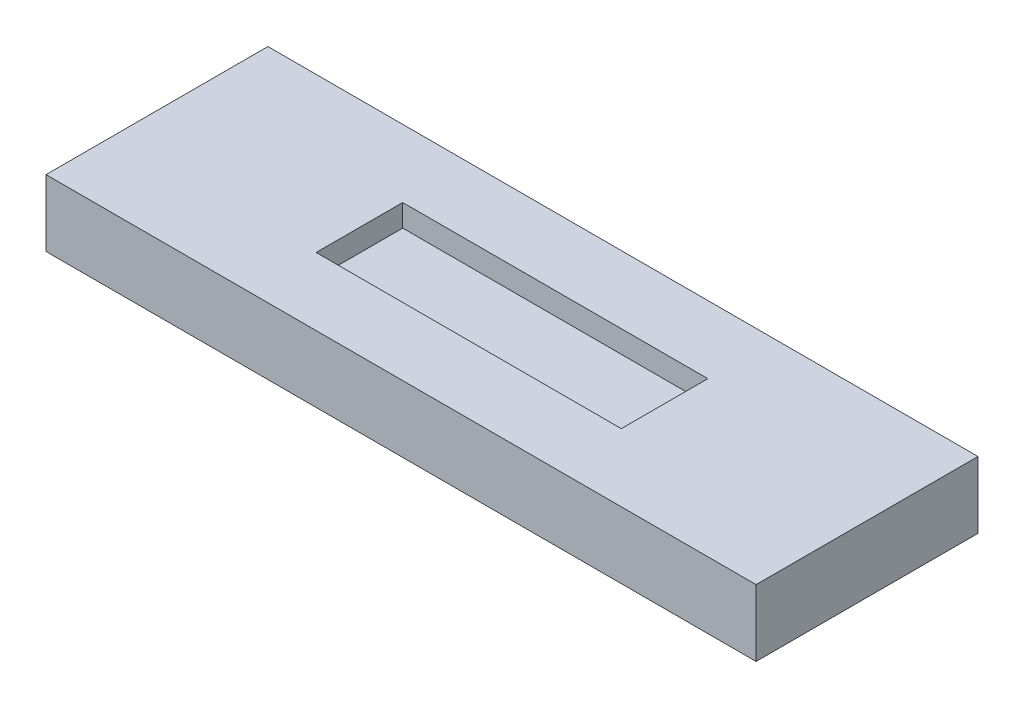
ISO-10303-21;
HEADER;
FILE_DESCRIPTION(('STEP AP214'),'2;1');
FILE_NAME('part.step','',(''),(''),'','','');
FILE_SCHEMA(('AUTOMOTIVE_DESIGN { 1 0 10303 214 1 1 1 1 }'));
ENDSEC;
DATA;
#1=APPLICATION_CONTEXT('core data for automotive mechanical design processes');
#2=APPLICATION_PROTOCOL_DEFINITION('international standard','automotive_design',2000,#1);
#3=PRODUCT_CONTEXT('',#1,'mechanical');
#4=PRODUCT('Part','Part','',(#3));
#5=PRODUCT_RELATED_PRODUCT_CATEGORY('part','',(#4));
#6=PRODUCT_DEFINITION_FORMATION('','',#4);
#7=PRODUCT_DEFINITION_CONTEXT('part definition',#1,'design');
#8=PRODUCT_DEFINITION('design','',#6,#7);
#9=PRODUCT_DEFINITION_SHAPE('','',#8);
#10=(LENGTH_UNIT() NAMED_UNIT(*) SI_UNIT(.MILLI.,.METRE.));
#11=(NAMED_UNIT(*) PLANE_ANGLE_UNIT() SI_UNIT($,.RADIAN.));
#12=(NAMED_UNIT(*) SI_UNIT($,.STERADIAN.) SOLID_ANGLE_UNIT());
#13=UNCERTAINTY_MEASURE_WITH_UNIT(LENGTH_MEASURE(1.E-05),#10,'distance_accuracy_value','');
#14=(GEOMETRIC_REPRESENTATION_CONTEXT(3) GLOBAL_UNCERTAINTY_ASSIGNED_CONTEXT((#13)) GLOBAL_UNIT_ASSIGNED_CONTEXT((#10,
#11,#12)) REPRESENTATION_CONTEXT('',''));
#15=CARTESIAN_POINT('',(0.,0.,0.));
#16=DIRECTION('',(0.,0.,1.));
#17=DIRECTION('',(1.,0.,0.));
#18=AXIS2_PLACEMENT_3D('',#15,#16,#17);
#19=CARTESIAN_POINT('',(16.,3.,5.));
#20=DIRECTION('',(-1.,0.,0.));
#21=DIRECTION('',(0.,0.,1.));
#22=AXIS2_PLACEMENT_3D('',#19,#20,#21);
#23=PLANE('',#22);
#24=DIRECTION('',(0.,0.,-1.));
#25=VECTOR('',#24,1.);
#26=CARTESIAN_POINT('',(16.,0.,5.));
#27=LINE('',#26,#25);
#28=CARTESIAN_POINT('',(16.,0.,5.));
#29=VERTEX_POINT('',#28);
#30=CARTESIAN_POINT('',(16.,0.,-5.));
#31=VERTEX_POINT('',#30);
#32=EDGE_CURVE('E141',#29,#31,#27,.T.);
#33=ORIENTED_EDGE('',*,*,#32,.T.);
#34=DIRECTION('',(0.,-1.,0.));
#35=VECTOR('',#34,1.);
#36=CARTESIAN_POINT('',(16.,3.,-5.));
#37=LINE('',#36,#35);
#38=CARTESIAN_POINT('',(16.,3.,-5.));
#39=VERTEX_POINT('',#38);
#40=EDGE_CURVE('E11',#39,#31,#37,.T.);
#41=ORIENTED_EDGE('',*,*,#40,.F.);
#42=DIRECTION('',(0.,0.,-1.));
#43=VECTOR('',#42,1.);
#44=CARTESIAN_POINT('',(16.,3.,5.));
#45=LINE('',#44,#43);
#46=CARTESIAN_POINT('',(16.,3.,5.));
#47=VERTEX_POINT('',#46);
#48=EDGE_CURVE('E145',#47,#39,#45,.T.);
#49=ORIENTED_EDGE('',*,*,#48,.F.);
#50=DIRECTION('',(0.,-1.,0.));
#51=VECTOR('',#50,1.);
#52=CARTESIAN_POINT('',(16.,3.,5.));
#53=LINE('',#52,#51);
#54=EDGE_CURVE('E151',#47,#29,#53,.T.);
#55=ORIENTED_EDGE('',*,*,#54,.T.);
#56=EDGE_LOOP('',(#33,#41,#49,#55));
#57=FACE_BOUND('',#56,.T.);
#58=ADVANCED_FACE('F33',(#57),#23,.F.);
#59=CARTESIAN_POINT('',(-16.,3.,-5.));
#60=DIRECTION('',(0.,0.,1.));
#61=DIRECTION('',(1.,0.,0.));
#62=AXIS2_PLACEMENT_3D('',#59,#60,#61);
#63=PLANE('',#62);
#64=DIRECTION('',(-1.,0.,0.));
#65=VECTOR('',#64,1.);
#66=CARTESIAN_POINT('',(-16.,0.,-5.));
#67=LINE('',#66,#65);
#68=CARTESIAN_POINT('',(-16.,0.,-5.));
#69=VERTEX_POINT('',#68);
#70=EDGE_CURVE('E154',#31,#69,#67,.T.);
#71=ORIENTED_EDGE('',*,*,#70,.T.);
#72=DIRECTION('',(0.,-1.,0.));
#73=VECTOR('',#72,1.);
#74=CARTESIAN_POINT('',(-16.,3.,-5.));
#75=LINE('',#74,#73);
#76=CARTESIAN_POINT('',(-16.,3.,-5.));
#77=VERTEX_POINT('',#76);
#78=EDGE_CURVE('E40',#77,#69,#75,.T.);
#79=ORIENTED_EDGE('',*,*,#78,.F.);
#80=DIRECTION('',(-1.,0.,0.));
#81=VECTOR('',#80,1.);
#82=CARTESIAN_POINT('',(-16.,3.,-5.));
#83=LINE('',#82,#81);
#84=EDGE_CURVE('E84',#39,#77,#83,.T.);
#85=ORIENTED_EDGE('',*,*,#84,.F.);
#86=ORIENTED_EDGE('',*,*,#40,.T.);
#87=EDGE_LOOP('',(#71,#79,#85,#86));
#88=FACE_BOUND('',#87,.T.);
#89=ADVANCED_FACE('F183',(#88),#63,.F.);
#90=CARTESIAN_POINT('',(-16.,3.,5.));
#91=DIRECTION('',(1.,0.,0.));
#92=DIRECTION('',(0.,0.,-1.));
#93=AXIS2_PLACEMENT_3D('',#90,#91,#92);
#94=PLANE('',#93);
#95=DIRECTION('',(0.,0.,1.));
#96=VECTOR('',#95,1.);
#97=CARTESIAN_POINT('',(-16.,0.,5.));
#98=LINE('',#97,#96);
#99=CARTESIAN_POINT('',(-16.,0.,5.));
#100=VERTEX_POINT('',#99);
#101=EDGE_CURVE('E156',#69,#100,#98,.T.);
#102=ORIENTED_EDGE('',*,*,#101,.T.);
#103=DIRECTION('',(0.,-1.,0.));
#104=VECTOR('',#103,1.);
#105=CARTESIAN_POINT('',(-16.,3.,5.));
#106=LINE('',#105,#104);
#107=CARTESIAN_POINT('',(-16.,3.,5.));
#108=VERTEX_POINT('',#107);
#109=EDGE_CURVE('E160',#108,#100,#106,.T.);
#110=ORIENTED_EDGE('',*,*,#109,.F.);
#111=DIRECTION('',(0.,0.,1.));
#112=VECTOR('',#111,1.);
#113=CARTESIAN_POINT('',(-16.,3.,5.));
#114=LINE('',#113,#112);
#115=EDGE_CURVE('E148',#77,#108,#114,.T.);
#116=ORIENTED_EDGE('',*,*,#115,.F.);
#117=ORIENTED_EDGE('',*,*,#78,.T.);
#118=EDGE_LOOP('',(#102,#110,#116,#117));
#119=FACE_BOUND('',#118,.T.);
#120=ADVANCED_FACE('F165',(#119),#94,.F.);
#121=CARTESIAN_POINT('',(-16.,3.,5.));
#122=DIRECTION('',(0.,0.,-1.));
#123=DIRECTION('',(-1.,0.,0.));
#124=AXIS2_PLACEMENT_3D('',#121,#122,#123);
#125=PLANE('',#124);
#126=DIRECTION('',(1.,0.,0.));
#127=VECTOR('',#126,1.);
#128=CARTESIAN_POINT('',(-16.,0.,5.));
#129=LINE('',#128,#127);
#130=EDGE_CURVE('E77',#100,#29,#129,.T.);
#131=ORIENTED_EDGE('',*,*,#130,.T.);
#132=ORIENTED_EDGE('',*,*,#54,.F.);
#133=DIRECTION('',(1.,0.,0.));
#134=VECTOR('',#133,1.);
#135=CARTESIAN_POINT('',(-16.,3.,5.));
#136=LINE('',#135,#134);
#137=EDGE_CURVE('E56',#108,#47,#136,.T.);
#138=ORIENTED_EDGE('',*,*,#137,.F.);
#139=ORIENTED_EDGE('',*,*,#109,.T.);
#140=EDGE_LOOP('',(#131,#132,#138,#139));
#141=FACE_BOUND('',#140,.T.);
#142=ADVANCED_FACE('F173',(#141),#125,.F.);
#143=CARTESIAN_POINT('',(0.,3.,0.));
#144=DIRECTION('',(0.,-1.,0.));
#145=DIRECTION('',(0.,0.,-1.));
#146=AXIS2_PLACEMENT_3D('',#143,#144,#145);
#147=PLANE('',#146);
#148=DIRECTION('',(-1.,0.,0.));
#149=VECTOR('',#148,1.);
#150=CARTESIAN_POINT('',(-6.875,3.,-1.95));
#151=LINE('',#150,#149);
#152=CARTESIAN_POINT('',(6.875,3.,-1.95));
#153=VERTEX_POINT('',#152);
#154=CARTESIAN_POINT('',(-6.875,3.,-1.95));
#155=VERTEX_POINT('',#154);
#156=EDGE_CURVE('E135',#153,#155,#151,.T.);
#157=ORIENTED_EDGE('',*,*,#156,.F.);
#158=DIRECTION('',(0.,0.,-1.));
#159=VECTOR('',#158,1.);
#160=CARTESIAN_POINT('',(6.875,3.,1.95));
#161=LINE('',#160,#159);
#162=CARTESIAN_POINT('',(6.875,3.,1.95));
#163=VERTEX_POINT('',#162);
#164=EDGE_CURVE('E47',#163,#153,#161,.T.);
#165=ORIENTED_EDGE('',*,*,#164,.F.);
#166=DIRECTION('',(1.,0.,0.));
#167=VECTOR('',#166,1.);
#168=CARTESIAN_POINT('',(-6.875,3.,1.95));
#169=LINE('',#168,#167);
#170=CARTESIAN_POINT('',(-6.875,3.,1.95));
#171=VERTEX_POINT('',#170);
#172=EDGE_CURVE('E126',#171,#163,#169,.T.);
#173=ORIENTED_EDGE('',*,*,#172,.F.);
#174=DIRECTION('',(0.,0.,1.));
#175=VECTOR('',#174,1.);
#176=CARTESIAN_POINT('',(-6.875,3.,1.95));
#177=LINE('',#176,#175);
#178=EDGE_CURVE('E129',#155,#171,#177,.T.);
#179=ORIENTED_EDGE('',*,*,#178,.F.);
#180=EDGE_LOOP('',(#157,#165,#173,#179));
#181=FACE_BOUND('',#180,.T.);
#182=ORIENTED_EDGE('',*,*,#48,.T.);
#183=ORIENTED_EDGE('',*,*,#84,.T.);
#184=ORIENTED_EDGE('',*,*,#115,.T.);
#185=ORIENTED_EDGE('',*,*,#137,.T.);
#186=EDGE_LOOP('',(#182,#183,#184,#185));
#187=FACE_BOUND('',#186,.T.);
#188=ADVANCED_FACE('F175',(#181,#187),#147,.F.);
#189=CARTESIAN_POINT('',(0.,0.,0.));
#190=DIRECTION('',(0.,-1.,0.));
#191=DIRECTION('',(0.,0.,-1.));
#192=AXIS2_PLACEMENT_3D('',#189,#190,#191);
#193=PLANE('',#192);
#194=ORIENTED_EDGE('',*,*,#32,.F.);
#195=ORIENTED_EDGE('',*,*,#130,.F.);
#196=ORIENTED_EDGE('',*,*,#101,.F.);
#197=ORIENTED_EDGE('',*,*,#70,.F.);
#198=EDGE_LOOP('',(#194,#195,#196,#197));
#199=FACE_BOUND('',#198,.T.);
#200=ADVANCED_FACE('F169',(#199),#193,.T.);
#201=CARTESIAN_POINT('',(6.875,2.,1.95));
#202=DIRECTION('',(1.,0.,0.));
#203=DIRECTION('',(0.,0.,-1.));
#204=AXIS2_PLACEMENT_3D('',#201,#202,#203);
#205=PLANE('',#204);
#206=ORIENTED_EDGE('',*,*,#164,.T.);
#207=DIRECTION('',(0.,1.,0.));
#208=VECTOR('',#207,1.);
#209=CARTESIAN_POINT('',(6.875,2.,-1.95));
#210=LINE('',#209,#208);
#211=CARTESIAN_POINT('',(6.875,2.,-1.95));
#212=VERTEX_POINT('',#211);
#213=EDGE_CURVE('E104',#212,#153,#210,.T.);
#214=ORIENTED_EDGE('',*,*,#213,.F.);
#215=DIRECTION('',(0.,0.,-1.));
#216=VECTOR('',#215,1.);
#217=CARTESIAN_POINT('',(6.875,2.,1.95));
#218=LINE('',#217,#216);
#219=CARTESIAN_POINT('',(6.875,2.,1.95));
#220=VERTEX_POINT('',#219);
#221=EDGE_CURVE('E108',#220,#212,#218,.T.);
#222=ORIENTED_EDGE('',*,*,#221,.F.);
#223=DIRECTION('',(0.,1.,0.));
#224=VECTOR('',#223,1.);
#225=CARTESIAN_POINT('',(6.875,2.,1.95));
#226=LINE('',#225,#224);
#227=EDGE_CURVE('E139',#220,#163,#226,.T.);
#228=ORIENTED_EDGE('',*,*,#227,.T.);
#229=EDGE_LOOP('',(#206,#214,#222,#228));
#230=FACE_BOUND('',#229,.T.);
#231=ADVANCED_FACE('F106',(#230),#205,.F.);
#232=CARTESIAN_POINT('',(-6.875,2.,1.95));
#233=DIRECTION('',(0.,0.,1.));
#234=DIRECTION('',(1.,0.,0.));
#235=AXIS2_PLACEMENT_3D('',#232,#233,#234);
#236=PLANE('',#235);
#237=ORIENTED_EDGE('',*,*,#172,.T.);
#238=ORIENTED_EDGE('',*,*,#227,.F.);
#239=DIRECTION('',(1.,0.,0.));
#240=VECTOR('',#239,1.);
#241=CARTESIAN_POINT('',(-6.875,2.,1.95));
#242=LINE('',#241,#240);
#243=CARTESIAN_POINT('',(-6.875,2.,1.95));
#244=VERTEX_POINT('',#243);
#245=EDGE_CURVE('E114',#244,#220,#242,.T.);
#246=ORIENTED_EDGE('',*,*,#245,.F.);
#247=DIRECTION('',(0.,1.,0.));
#248=VECTOR('',#247,1.);
#249=CARTESIAN_POINT('',(-6.875,2.,1.95));
#250=LINE('',#249,#248);
#251=EDGE_CURVE('E142',#244,#171,#250,.T.);
#252=ORIENTED_EDGE('',*,*,#251,.T.);
#253=EDGE_LOOP('',(#237,#238,#246,#252));
#254=FACE_BOUND('',#253,.T.);
#255=ADVANCED_FACE('F222',(#254),#236,.F.);
#256=CARTESIAN_POINT('',(-6.875,2.,1.95));
#257=DIRECTION('',(-1.,0.,0.));
#258=DIRECTION('',(0.,0.,1.));
#259=AXIS2_PLACEMENT_3D('',#256,#257,#258);
#260=PLANE('',#259);
#261=ORIENTED_EDGE('',*,*,#178,.T.);
#262=ORIENTED_EDGE('',*,*,#251,.F.);
#263=DIRECTION('',(0.,0.,1.));
#264=VECTOR('',#263,1.);
#265=CARTESIAN_POINT('',(-6.875,2.,1.95));
#266=LINE('',#265,#264);
#267=CARTESIAN_POINT('',(-6.875,2.,-1.95));
#268=VERTEX_POINT('',#267);
#269=EDGE_CURVE('E122',#268,#244,#266,.T.);
#270=ORIENTED_EDGE('',*,*,#269,.F.);
#271=DIRECTION('',(0.,1.,0.));
#272=VECTOR('',#271,1.);
#273=CARTESIAN_POINT('',(-6.875,2.,-1.95));
#274=LINE('',#273,#272);
#275=EDGE_CURVE('E113',#268,#155,#274,.T.);
#276=ORIENTED_EDGE('',*,*,#275,.T.);
#277=EDGE_LOOP('',(#261,#262,#270,#276));
#278=FACE_BOUND('',#277,.T.);
#279=ADVANCED_FACE('F231',(#278),#260,.F.);
#280=CARTESIAN_POINT('',(-6.875,2.,-1.95));
#281=DIRECTION('',(0.,0.,-1.));
#282=DIRECTION('',(-1.,0.,0.));
#283=AXIS2_PLACEMENT_3D('',#280,#281,#282);
#284=PLANE('',#283);
#285=ORIENTED_EDGE('',*,*,#156,.T.);
#286=ORIENTED_EDGE('',*,*,#275,.F.);
#287=DIRECTION('',(-1.,0.,0.));
#288=VECTOR('',#287,1.);
#289=CARTESIAN_POINT('',(-6.875,2.,-1.95));
#290=LINE('',#289,#288);
#291=EDGE_CURVE('E117',#212,#268,#290,.T.);
#292=ORIENTED_EDGE('',*,*,#291,.F.);
#293=ORIENTED_EDGE('',*,*,#213,.T.);
#294=EDGE_LOOP('',(#285,#286,#292,#293));
#295=FACE_BOUND('',#294,.T.);
#296=ADVANCED_FACE('F118',(#295),#284,.F.);
#297=CARTESIAN_POINT('',(0.,2.,0.));
#298=DIRECTION('',(0.,-1.,0.));
#299=DIRECTION('',(0.,0.,-1.));
#300=AXIS2_PLACEMENT_3D('',#297,#298,#299);
#301=PLANE('',#300);
#302=ORIENTED_EDGE('',*,*,#221,.T.);
#303=ORIENTED_EDGE('',*,*,#291,.T.);
#304=ORIENTED_EDGE('',*,*,#269,.T.);
#305=ORIENTED_EDGE('',*,*,#245,.T.);
#306=EDGE_LOOP('',(#302,#303,#304,#305));
#307=FACE_BOUND('',#306,.T.);
#308=ADVANCED_FACE('F124',(#307),#301,.F.);
#309=CLOSED_SHELL('',(#58,#89,#120,#142,#188,#200,#231,#255,#279,#296,#308));
#310=MANIFOLD_SOLID_BREP('B2',#309);
#311=ADVANCED_BREP_SHAPE_REPRESENTATION('',(#18,#310),#14);
#312=SHAPE_DEFINITION_REPRESENTATION(#9,#311);
ENDSEC;
END-ISO-10303-21;
